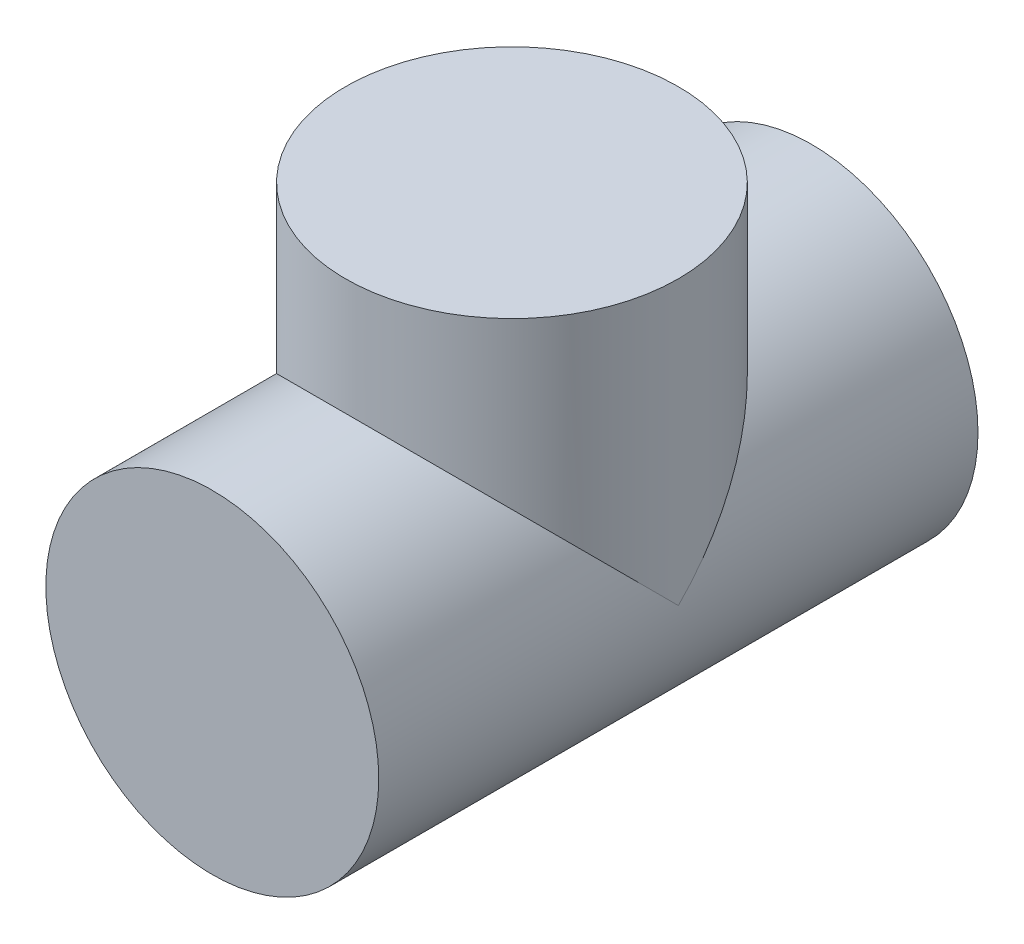
ISO-10303-21;
HEADER;
FILE_DESCRIPTION(('STEP AP214'),'2;1');
FILE_NAME('part.step','',(''),(''),'','','');
FILE_SCHEMA(('AUTOMOTIVE_DESIGN { 1 0 10303 214 1 1 1 1 }'));
ENDSEC;
DATA;
#1=APPLICATION_CONTEXT('core data for automotive mechanical design processes');
#2=APPLICATION_PROTOCOL_DEFINITION('international standard','automotive_design',2000,#1);
#3=PRODUCT_CONTEXT('',#1,'mechanical');
#4=PRODUCT('Part','Part','',(#3));
#5=PRODUCT_RELATED_PRODUCT_CATEGORY('part','',(#4));
#6=PRODUCT_DEFINITION_FORMATION('','',#4);
#7=PRODUCT_DEFINITION_CONTEXT('part definition',#1,'design');
#8=PRODUCT_DEFINITION('design','',#6,#7);
#9=PRODUCT_DEFINITION_SHAPE('','',#8);
#10=(LENGTH_UNIT() NAMED_UNIT(*) SI_UNIT(.MILLI.,.METRE.));
#11=(NAMED_UNIT(*) PLANE_ANGLE_UNIT() SI_UNIT($,.RADIAN.));
#12=(NAMED_UNIT(*) SI_UNIT($,.STERADIAN.) SOLID_ANGLE_UNIT());
#13=UNCERTAINTY_MEASURE_WITH_UNIT(LENGTH_MEASURE(1.E-05),#10,'distance_accuracy_value','');
#14=(GEOMETRIC_REPRESENTATION_CONTEXT(3) GLOBAL_UNCERTAINTY_ASSIGNED_CONTEXT((#13)) GLOBAL_UNIT_ASSIGNED_CONTEXT((#10,
#11,#12)) REPRESENTATION_CONTEXT('',''));
#15=CARTESIAN_POINT('',(0.,0.,0.));
#16=DIRECTION('',(0.,0.,1.));
#17=DIRECTION('',(1.,0.,0.));
#18=AXIS2_PLACEMENT_3D('',#15,#16,#17);
#19=CARTESIAN_POINT('',(0.,-110.1,-45.));
#20=DIRECTION('',(0.,1.,0.));
#21=DIRECTION('',(0.,0.,1.));
#22=AXIS2_PLACEMENT_3D('',#19,#20,#21);
#23=CYLINDRICAL_SURFACE('',#22,50.);
#24=CARTESIAN_POINT('',(0.,85.,-45.));
#25=DIRECTION('',(0.,-1.,0.));
#26=DIRECTION('',(1.,0.,0.));
#27=AXIS2_PLACEMENT_3D('',#24,#25,#26);
#28=CIRCLE('',#27,50.);
#29=CARTESIAN_POINT('',(50.,85.,-45.));
#30=VERTEX_POINT('',#29);
#31=EDGE_CURVE('E44',#30,#30,#28,.T.);
#32=ORIENTED_EDGE('',*,*,#31,.T.);
#33=EDGE_LOOP('',(#32));
#34=FACE_BOUND('',#33,.T.);
#35=CARTESIAN_POINT('',(0.,0.,-45.));
#36=DIRECTION('',(0.,0.707106781186547,0.707106781186547));
#37=DIRECTION('',(0.,-0.707106781186548,0.707106781186548));
#38=AXIS2_PLACEMENT_3D('',#35,#36,#37);
#39=ELLIPSE('',#38,70.7106781186548,50.);
#40=CARTESIAN_POINT('',(50.,0.,-45.));
#41=VERTEX_POINT('',#40);
#42=CARTESIAN_POINT('',(-50.,0.,-45.));
#43=VERTEX_POINT('',#42);
#44=EDGE_CURVE('E59',#41,#43,#39,.T.);
#45=ORIENTED_EDGE('',*,*,#44,.T.);
#46=CARTESIAN_POINT('',(0.,0.,-45.));
#47=DIRECTION('',(0.,0.707106781186547,-0.707106781186547));
#48=DIRECTION('',(0.,-0.707106781186548,-0.707106781186548));
#49=AXIS2_PLACEMENT_3D('',#46,#47,#48);
#50=ELLIPSE('',#49,70.7106781186548,50.);
#51=EDGE_CURVE('E11',#43,#41,#50,.T.);
#52=ORIENTED_EDGE('',*,*,#51,.T.);
#53=EDGE_LOOP('',(#45,#52));
#54=FACE_BOUND('',#53,.T.);
#55=ADVANCED_FACE('F40',(#34,#54),#23,.T.);
#56=CARTESIAN_POINT('',(0.,85.,-45.));
#57=DIRECTION('',(0.,-1.,0.));
#58=DIRECTION('',(1.,0.,0.));
#59=AXIS2_PLACEMENT_3D('',#56,#57,#58);
#60=PLANE('',#59);
#61=ORIENTED_EDGE('',*,*,#31,.F.);
#62=EDGE_LOOP('',(#61));
#63=FACE_BOUND('',#62,.T.);
#64=ADVANCED_FACE('F42',(#63),#60,.F.);
#65=CARTESIAN_POINT('',(0.,0.,45.));
#66=DIRECTION('',(0.,0.,1.));
#67=DIRECTION('',(1.,0.,0.));
#68=AXIS2_PLACEMENT_3D('',#65,#66,#67);
#69=PLANE('',#68);
#70=CARTESIAN_POINT('',(0.,0.,45.));
#71=DIRECTION('',(0.,0.,1.));
#72=DIRECTION('',(1.,0.,0.));
#73=AXIS2_PLACEMENT_3D('',#70,#71,#72);
#74=CIRCLE('',#73,50.);
#75=CARTESIAN_POINT('',(50.,0.,45.));
#76=VERTEX_POINT('',#75);
#77=EDGE_CURVE('E50',#76,#76,#74,.T.);
#78=ORIENTED_EDGE('',*,*,#77,.T.);
#79=EDGE_LOOP('',(#78));
#80=FACE_BOUND('',#79,.T.);
#81=ADVANCED_FACE('F73',(#80),#69,.T.);
#82=CARTESIAN_POINT('',(0.,0.,45.));
#83=DIRECTION('',(0.,0.,-1.));
#84=DIRECTION('',(-1.,0.,0.));
#85=AXIS2_PLACEMENT_3D('',#82,#83,#84);
#86=CYLINDRICAL_SURFACE('',#85,50.);
#87=ORIENTED_EDGE('',*,*,#51,.F.);
#88=ORIENTED_EDGE('',*,*,#44,.F.);
#89=EDGE_LOOP('',(#87,#88));
#90=FACE_BOUND('',#89,.T.);
#91=ORIENTED_EDGE('',*,*,#77,.F.);
#92=EDGE_LOOP('',(#91));
#93=FACE_BOUND('',#92,.T.);
#94=CARTESIAN_POINT('',(0.,0.,-135.));
#95=DIRECTION('',(0.,0.,1.));
#96=DIRECTION('',(1.,0.,0.));
#97=AXIS2_PLACEMENT_3D('',#94,#95,#96);
#98=CIRCLE('',#97,50.);
#99=CARTESIAN_POINT('',(50.,0.,-135.));
#100=VERTEX_POINT('',#99);
#101=EDGE_CURVE('E61',#100,#100,#98,.F.);
#102=ORIENTED_EDGE('',*,*,#101,.F.);
#103=EDGE_LOOP('',(#102));
#104=FACE_BOUND('',#103,.T.);
#105=ADVANCED_FACE('F57',(#90,#93,#104),#86,.T.);
#106=CARTESIAN_POINT('',(0.,0.,-135.));
#107=DIRECTION('',(0.,0.,-1.));
#108=DIRECTION('',(1.,0.,0.));
#109=AXIS2_PLACEMENT_3D('',#106,#107,#108);
#110=PLANE('',#109);
#111=ORIENTED_EDGE('',*,*,#101,.T.);
#112=EDGE_LOOP('',(#111));
#113=FACE_BOUND('',#112,.T.);
#114=ADVANCED_FACE('F76',(#113),#110,.T.);
#115=CLOSED_SHELL('',(#55,#64,#81,#105,#114));
#116=MANIFOLD_SOLID_BREP('B2',#115);
#117=ADVANCED_BREP_SHAPE_REPRESENTATION('',(#18,#116),#14);
#118=SHAPE_DEFINITION_REPRESENTATION(#9,#117);
ENDSEC;
END-ISO-10303-21;
